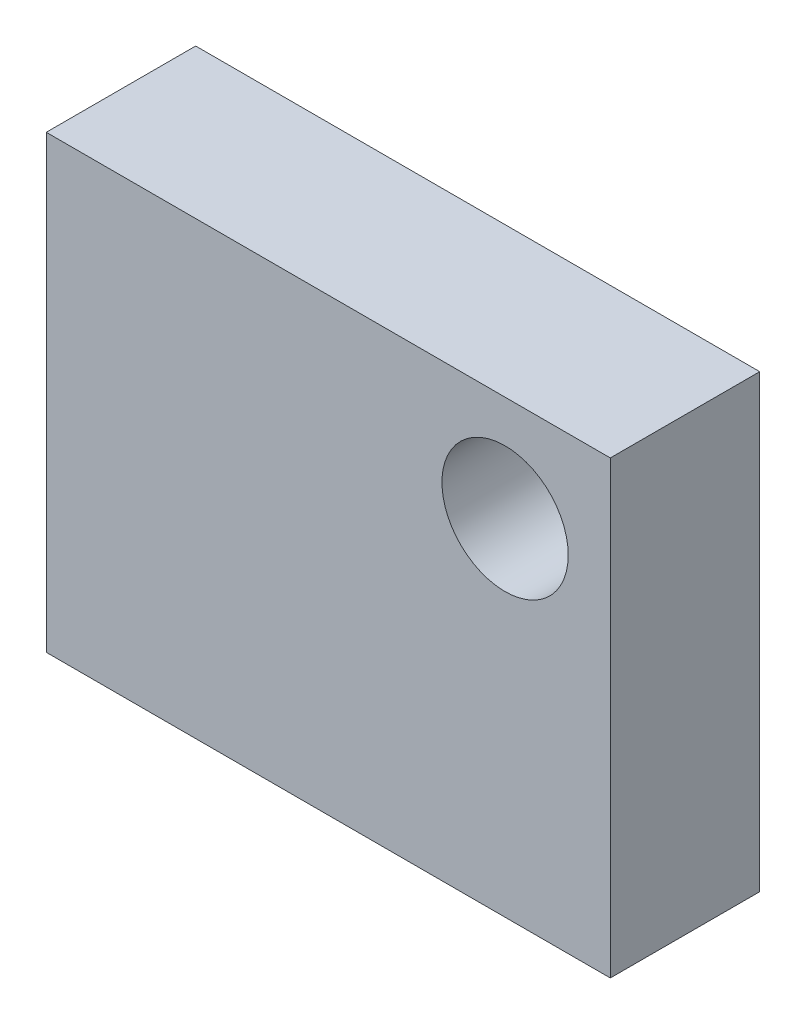
ISO-10303-21;
HEADER;
FILE_DESCRIPTION(('STEP AP214'),'2;1');
FILE_NAME('part.step','',(''),(''),'','','');
FILE_SCHEMA(('AUTOMOTIVE_DESIGN { 1 0 10303 214 1 1 1 1 }'));
ENDSEC;
DATA;
#1=APPLICATION_CONTEXT('core data for automotive mechanical design processes');
#2=APPLICATION_PROTOCOL_DEFINITION('international standard','automotive_design',2000,#1);
#3=PRODUCT_CONTEXT('',#1,'mechanical');
#4=PRODUCT('Part','Part','',(#3));
#5=PRODUCT_RELATED_PRODUCT_CATEGORY('part','',(#4));
#6=PRODUCT_DEFINITION_FORMATION('','',#4);
#7=PRODUCT_DEFINITION_CONTEXT('part definition',#1,'design');
#8=PRODUCT_DEFINITION('design','',#6,#7);
#9=PRODUCT_DEFINITION_SHAPE('','',#8);
#10=(LENGTH_UNIT() NAMED_UNIT(*) SI_UNIT(.MILLI.,.METRE.));
#11=(NAMED_UNIT(*) PLANE_ANGLE_UNIT() SI_UNIT($,.RADIAN.));
#12=(NAMED_UNIT(*) SI_UNIT($,.STERADIAN.) SOLID_ANGLE_UNIT());
#13=UNCERTAINTY_MEASURE_WITH_UNIT(LENGTH_MEASURE(1.E-05),#10,'distance_accuracy_value','');
#14=(GEOMETRIC_REPRESENTATION_CONTEXT(3) GLOBAL_UNCERTAINTY_ASSIGNED_CONTEXT((#13)) GLOBAL_UNIT_ASSIGNED_CONTEXT((#10,
#11,#12)) REPRESENTATION_CONTEXT('',''));
#15=CARTESIAN_POINT('',(0.,0.,0.));
#16=DIRECTION('',(0.,0.,1.));
#17=DIRECTION('',(1.,0.,0.));
#18=AXIS2_PLACEMENT_3D('',#15,#16,#17);
#19=CARTESIAN_POINT('',(6.7,5.35,3.55));
#20=DIRECTION('',(-1.,0.,0.));
#21=DIRECTION('',(0.,-1.,0.));
#22=AXIS2_PLACEMENT_3D('',#19,#20,#21);
#23=PLANE('',#22);
#24=DIRECTION('',(0.,1.,0.));
#25=VECTOR('',#24,1.);
#26=CARTESIAN_POINT('',(6.7,5.35,0.));
#27=LINE('',#26,#25);
#28=CARTESIAN_POINT('',(6.7,-5.35,0.));
#29=VERTEX_POINT('',#28);
#30=CARTESIAN_POINT('',(6.7,5.35,0.));
#31=VERTEX_POINT('',#30);
#32=EDGE_CURVE('E99',#29,#31,#27,.T.);
#33=ORIENTED_EDGE('',*,*,#32,.T.);
#34=DIRECTION('',(0.,0.,-1.));
#35=VECTOR('',#34,1.);
#36=CARTESIAN_POINT('',(6.7,5.35,3.55));
#37=LINE('',#36,#35);
#38=CARTESIAN_POINT('',(6.7,5.35,3.55));
#39=VERTEX_POINT('',#38);
#40=EDGE_CURVE('E11',#39,#31,#37,.T.);
#41=ORIENTED_EDGE('',*,*,#40,.F.);
#42=DIRECTION('',(0.,1.,0.));
#43=VECTOR('',#42,1.);
#44=CARTESIAN_POINT('',(6.7,5.35,3.55));
#45=LINE('',#44,#43);
#46=CARTESIAN_POINT('',(6.7,-5.35,3.55));
#47=VERTEX_POINT('',#46);
#48=EDGE_CURVE('E87',#47,#39,#45,.T.);
#49=ORIENTED_EDGE('',*,*,#48,.F.);
#50=DIRECTION('',(0.,0.,-1.));
#51=VECTOR('',#50,1.);
#52=CARTESIAN_POINT('',(6.7,-5.35,3.55));
#53=LINE('',#52,#51);
#54=EDGE_CURVE('E95',#47,#29,#53,.T.);
#55=ORIENTED_EDGE('',*,*,#54,.T.);
#56=EDGE_LOOP('',(#33,#41,#49,#55));
#57=FACE_BOUND('',#56,.T.);
#58=ADVANCED_FACE('F36',(#57),#23,.F.);
#59=CARTESIAN_POINT('',(-6.7,5.35,3.55));
#60=DIRECTION('',(0.,-1.,0.));
#61=DIRECTION('',(0.,0.,-1.));
#62=AXIS2_PLACEMENT_3D('',#59,#60,#61);
#63=PLANE('',#62);
#64=DIRECTION('',(-1.,0.,0.));
#65=VECTOR('',#64,1.);
#66=CARTESIAN_POINT('',(-6.7,5.35,0.));
#67=LINE('',#66,#65);
#68=CARTESIAN_POINT('',(-6.7,5.35,0.));
#69=VERTEX_POINT('',#68);
#70=EDGE_CURVE('E91',#31,#69,#67,.T.);
#71=ORIENTED_EDGE('',*,*,#70,.T.);
#72=DIRECTION('',(0.,0.,-1.));
#73=VECTOR('',#72,1.);
#74=CARTESIAN_POINT('',(-6.7,5.35,3.55));
#75=LINE('',#74,#73);
#76=CARTESIAN_POINT('',(-6.7,5.35,3.55));
#77=VERTEX_POINT('',#76);
#78=EDGE_CURVE('E44',#77,#69,#75,.T.);
#79=ORIENTED_EDGE('',*,*,#78,.F.);
#80=DIRECTION('',(-1.,0.,0.));
#81=VECTOR('',#80,1.);
#82=CARTESIAN_POINT('',(-6.7,5.35,3.55));
#83=LINE('',#82,#81);
#84=EDGE_CURVE('E82',#39,#77,#83,.T.);
#85=ORIENTED_EDGE('',*,*,#84,.F.);
#86=ORIENTED_EDGE('',*,*,#40,.T.);
#87=EDGE_LOOP('',(#71,#79,#85,#86));
#88=FACE_BOUND('',#87,.T.);
#89=ADVANCED_FACE('F90',(#88),#63,.F.);
#90=CARTESIAN_POINT('',(-6.7,5.35,3.55));
#91=DIRECTION('',(1.,0.,0.));
#92=DIRECTION('',(0.,1.,0.));
#93=AXIS2_PLACEMENT_3D('',#90,#91,#92);
#94=PLANE('',#93);
#95=DIRECTION('',(0.,-1.,0.));
#96=VECTOR('',#95,1.);
#97=CARTESIAN_POINT('',(-6.7,5.35,0.));
#98=LINE('',#97,#96);
#99=CARTESIAN_POINT('',(-6.7,-5.35,0.));
#100=VERTEX_POINT('',#99);
#101=EDGE_CURVE('E69',#69,#100,#98,.T.);
#102=ORIENTED_EDGE('',*,*,#101,.T.);
#103=DIRECTION('',(0.,0.,-1.));
#104=VECTOR('',#103,1.);
#105=CARTESIAN_POINT('',(-6.7,-5.35,3.55));
#106=LINE('',#105,#104);
#107=CARTESIAN_POINT('',(-6.7,-5.35,3.55));
#108=VERTEX_POINT('',#107);
#109=EDGE_CURVE('E92',#108,#100,#106,.T.);
#110=ORIENTED_EDGE('',*,*,#109,.F.);
#111=DIRECTION('',(0.,-1.,0.));
#112=VECTOR('',#111,1.);
#113=CARTESIAN_POINT('',(-6.7,5.35,3.55));
#114=LINE('',#113,#112);
#115=EDGE_CURVE('E85',#77,#108,#114,.T.);
#116=ORIENTED_EDGE('',*,*,#115,.F.);
#117=ORIENTED_EDGE('',*,*,#78,.T.);
#118=EDGE_LOOP('',(#102,#110,#116,#117));
#119=FACE_BOUND('',#118,.T.);
#120=ADVANCED_FACE('F93',(#119),#94,.F.);
#121=CARTESIAN_POINT('',(-6.7,-5.35,3.55));
#122=DIRECTION('',(0.,1.,0.));
#123=DIRECTION('',(0.,0.,1.));
#124=AXIS2_PLACEMENT_3D('',#121,#122,#123);
#125=PLANE('',#124);
#126=DIRECTION('',(1.,0.,0.));
#127=VECTOR('',#126,1.);
#128=CARTESIAN_POINT('',(-6.7,-5.35,0.));
#129=LINE('',#128,#127);
#130=EDGE_CURVE('E75',#100,#29,#129,.T.);
#131=ORIENTED_EDGE('',*,*,#130,.T.);
#132=ORIENTED_EDGE('',*,*,#54,.F.);
#133=DIRECTION('',(1.,0.,0.));
#134=VECTOR('',#133,1.);
#135=CARTESIAN_POINT('',(-6.7,-5.35,3.55));
#136=LINE('',#135,#134);
#137=EDGE_CURVE('E52',#108,#47,#136,.T.);
#138=ORIENTED_EDGE('',*,*,#137,.F.);
#139=ORIENTED_EDGE('',*,*,#109,.T.);
#140=EDGE_LOOP('',(#131,#132,#138,#139));
#141=FACE_BOUND('',#140,.T.);
#142=ADVANCED_FACE('F107',(#141),#125,.F.);
#143=CARTESIAN_POINT('',(0.,0.,3.55));
#144=DIRECTION('',(0.,0.,1.));
#145=DIRECTION('',(1.,0.,0.));
#146=AXIS2_PLACEMENT_3D('',#143,#144,#145);
#147=PLANE('',#146);
#148=CARTESIAN_POINT('',(4.2,2.85,3.55));
#149=DIRECTION('',(0.,0.,1.));
#150=DIRECTION('',(1.,0.,0.));
#151=AXIS2_PLACEMENT_3D('',#148,#149,#150);
#152=CIRCLE('',#151,1.5);
#153=CARTESIAN_POINT('',(5.7,2.85,3.55));
#154=VERTEX_POINT('',#153);
#155=EDGE_CURVE('E113',#154,#154,#152,.T.);
#156=ORIENTED_EDGE('',*,*,#155,.F.);
#157=EDGE_LOOP('',(#156));
#158=FACE_BOUND('',#157,.T.);
#159=ORIENTED_EDGE('',*,*,#48,.T.);
#160=ORIENTED_EDGE('',*,*,#84,.T.);
#161=ORIENTED_EDGE('',*,*,#115,.T.);
#162=ORIENTED_EDGE('',*,*,#137,.T.);
#163=EDGE_LOOP('',(#159,#160,#161,#162));
#164=FACE_BOUND('',#163,.T.);
#165=ADVANCED_FACE('F83',(#158,#164),#147,.T.);
#166=CARTESIAN_POINT('',(0.,0.,0.));
#167=DIRECTION('',(0.,0.,1.));
#168=DIRECTION('',(1.,0.,0.));
#169=AXIS2_PLACEMENT_3D('',#166,#167,#168);
#170=PLANE('',#169);
#171=CARTESIAN_POINT('',(4.2,2.85,0.));
#172=DIRECTION('',(0.,0.,1.));
#173=DIRECTION('',(1.,0.,0.));
#174=AXIS2_PLACEMENT_3D('',#171,#172,#173);
#175=CIRCLE('',#174,1.5);
#176=CARTESIAN_POINT('',(5.7,2.85,0.));
#177=VERTEX_POINT('',#176);
#178=EDGE_CURVE('E102',#177,#177,#175,.T.);
#179=ORIENTED_EDGE('',*,*,#178,.T.);
#180=EDGE_LOOP('',(#179));
#181=FACE_BOUND('',#180,.T.);
#182=ORIENTED_EDGE('',*,*,#32,.F.);
#183=ORIENTED_EDGE('',*,*,#130,.F.);
#184=ORIENTED_EDGE('',*,*,#101,.F.);
#185=ORIENTED_EDGE('',*,*,#70,.F.);
#186=EDGE_LOOP('',(#182,#183,#184,#185));
#187=FACE_BOUND('',#186,.T.);
#188=ADVANCED_FACE('F110',(#181,#187),#170,.F.);
#189=CARTESIAN_POINT('',(4.2,2.85,0.));
#190=DIRECTION('',(0.,0.,1.));
#191=DIRECTION('',(1.,0.,0.));
#192=AXIS2_PLACEMENT_3D('',#189,#190,#191);
#193=CYLINDRICAL_SURFACE('',#192,1.5);
#194=ORIENTED_EDGE('',*,*,#178,.F.);
#195=EDGE_LOOP('',(#194));
#196=FACE_BOUND('',#195,.T.);
#197=ORIENTED_EDGE('',*,*,#155,.T.);
#198=EDGE_LOOP('',(#197));
#199=FACE_BOUND('',#198,.T.);
#200=ADVANCED_FACE('F120',(#196,#199),#193,.F.);
#201=CLOSED_SHELL('',(#58,#89,#120,#142,#165,#188,#200));
#202=MANIFOLD_SOLID_BREP('B2',#201);
#203=ADVANCED_BREP_SHAPE_REPRESENTATION('',(#18,#202),#14);
#204=SHAPE_DEFINITION_REPRESENTATION(#9,#203);
ENDSEC;
END-ISO-10303-21;
